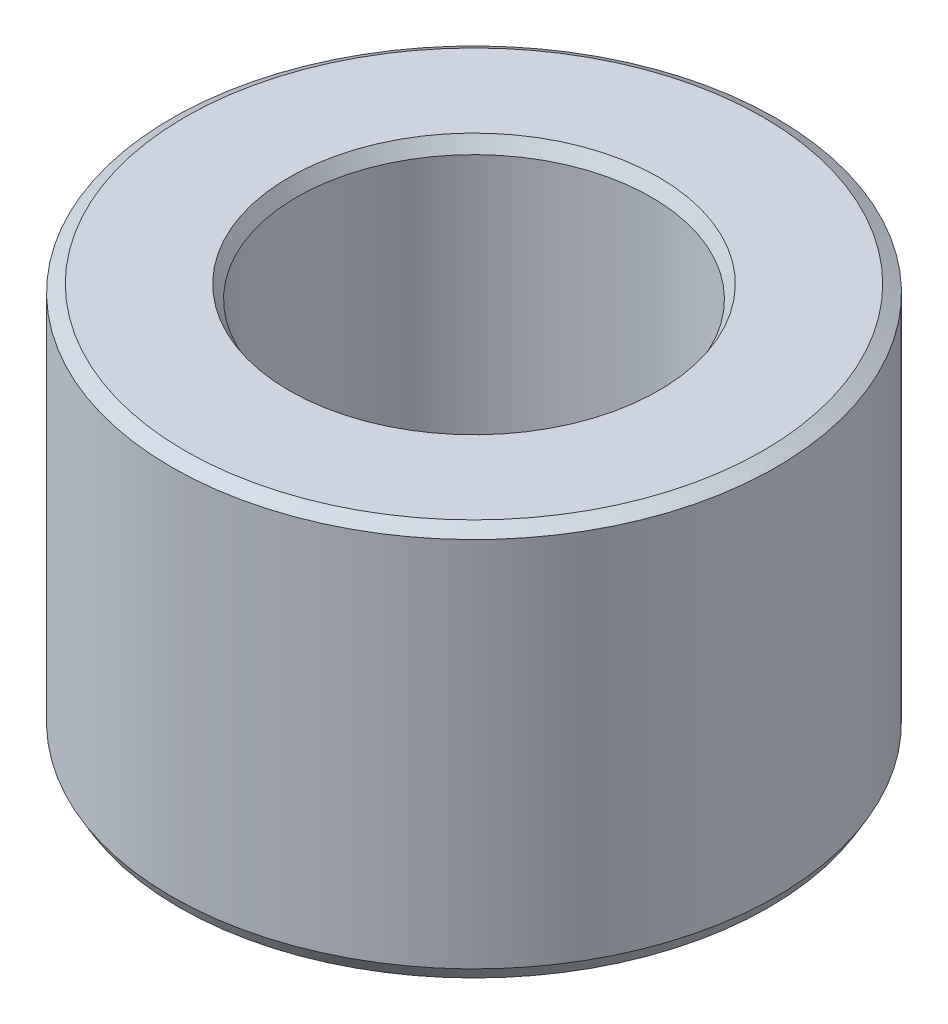
ISO-10303-21;
HEADER;
FILE_DESCRIPTION(('STEP AP214'),'2;1');
FILE_NAME('part.step','',(''),(''),'','','');
FILE_SCHEMA(('AUTOMOTIVE_DESIGN { 1 0 10303 214 1 1 1 1 }'));
ENDSEC;
DATA;
#1=APPLICATION_CONTEXT('core data for automotive mechanical design processes');
#2=APPLICATION_PROTOCOL_DEFINITION('international standard','automotive_design',2000,#1);
#3=PRODUCT_CONTEXT('',#1,'mechanical');
#4=PRODUCT('Part','Part','',(#3));
#5=PRODUCT_RELATED_PRODUCT_CATEGORY('part','',(#4));
#6=PRODUCT_DEFINITION_FORMATION('','',#4);
#7=PRODUCT_DEFINITION_CONTEXT('part definition',#1,'design');
#8=PRODUCT_DEFINITION('design','',#6,#7);
#9=PRODUCT_DEFINITION_SHAPE('','',#8);
#10=(LENGTH_UNIT() NAMED_UNIT(*) SI_UNIT(.MILLI.,.METRE.));
#11=(NAMED_UNIT(*) PLANE_ANGLE_UNIT() SI_UNIT($,.RADIAN.));
#12=(NAMED_UNIT(*) SI_UNIT($,.STERADIAN.) SOLID_ANGLE_UNIT());
#13=UNCERTAINTY_MEASURE_WITH_UNIT(LENGTH_MEASURE(1.E-05),#10,'distance_accuracy_value','');
#14=(GEOMETRIC_REPRESENTATION_CONTEXT(3) GLOBAL_UNCERTAINTY_ASSIGNED_CONTEXT((#13)) GLOBAL_UNIT_ASSIGNED_CONTEXT((#10,
#11,#12)) REPRESENTATION_CONTEXT('',''));
#15=CARTESIAN_POINT('',(0.,0.,0.));
#16=DIRECTION('',(0.,0.,1.));
#17=DIRECTION('',(1.,0.,0.));
#18=AXIS2_PLACEMENT_3D('',#15,#16,#17);
#19=CARTESIAN_POINT('',(0.,45.4759691105106,0.));
#20=DIRECTION('',(0.,-1.,0.));
#21=DIRECTION('',(0.,0.,-1.));
#22=AXIS2_PLACEMENT_3D('',#19,#20,#21);
#23=CYLINDRICAL_SURFACE('',#22,35.);
#24=CARTESIAN_POINT('',(0.,1.53578609781814,0.));
#25=DIRECTION('',(0.,1.,0.));
#26=DIRECTION('',(0.,0.,1.));
#27=AXIS2_PLACEMENT_3D('',#24,#25,#26);
#28=CIRCLE('',#27,35.);
#29=CARTESIAN_POINT('',(0.,1.53578609781814,35.));
#30=VERTEX_POINT('',#29);
#31=EDGE_CURVE('E10',#30,#30,#28,.T.);
#32=ORIENTED_EDGE('',*,*,#31,.T.);
#33=EDGE_LOOP('',(#32));
#34=FACE_BOUND('',#33,.T.);
#35=CARTESIAN_POINT('',(0.,44.5892825935176,0.));
#36=DIRECTION('',(0.,1.,0.));
#37=DIRECTION('',(0.,0.,1.));
#38=AXIS2_PLACEMENT_3D('',#35,#36,#37);
#39=CIRCLE('',#38,35.);
#40=CARTESIAN_POINT('',(0.,44.5892825935176,-35.));
#41=VERTEX_POINT('',#40);
#42=EDGE_CURVE('E50',#41,#41,#39,.F.);
#43=ORIENTED_EDGE('',*,*,#42,.T.);
#44=EDGE_LOOP('',(#43));
#45=FACE_BOUND('',#44,.T.);
#46=ADVANCED_FACE('F39',(#34,#45),#23,.T.);
#47=CARTESIAN_POINT('',(0.,45.4759691105106,0.));
#48=DIRECTION('',(0.,1.,0.));
#49=DIRECTION('',(0.,0.,1.));
#50=AXIS2_PLACEMENT_3D('',#47,#48,#49);
#51=PLANE('',#50);
#52=CARTESIAN_POINT('',(0.,45.4759691105106,0.));
#53=DIRECTION('',(0.,1.,0.));
#54=DIRECTION('',(0.,0.,1.));
#55=AXIS2_PLACEMENT_3D('',#52,#53,#54);
#56=CIRCLE('',#55,21.3956241786913);
#57=CARTESIAN_POINT('',(0.,45.4759691105106,21.3956241786913));
#58=VERTEX_POINT('',#57);
#59=EDGE_CURVE('E58',#58,#58,#56,.F.);
#60=ORIENTED_EDGE('',*,*,#59,.T.);
#61=EDGE_LOOP('',(#60));
#62=FACE_BOUND('',#61,.T.);
#63=CARTESIAN_POINT('',(0.,45.4759691105106,0.));
#64=DIRECTION('',(0.,1.,0.));
#65=DIRECTION('',(0.,0.,1.));
#66=AXIS2_PLACEMENT_3D('',#63,#64,#65);
#67=CIRCLE('',#66,33.4642139021818);
#68=CARTESIAN_POINT('',(0.,45.4759691105106,-33.4642139021819));
#69=VERTEX_POINT('',#68);
#70=EDGE_CURVE('E61',#69,#69,#67,.T.);
#71=ORIENTED_EDGE('',*,*,#70,.T.);
#72=EDGE_LOOP('',(#71));
#73=FACE_BOUND('',#72,.T.);
#74=ADVANCED_FACE('F88',(#62,#73),#51,.T.);
#75=CARTESIAN_POINT('',(0.,0.,0.));
#76=DIRECTION('',(0.,1.,0.));
#77=DIRECTION('',(0.,0.,1.));
#78=AXIS2_PLACEMENT_3D('',#75,#76,#77);
#79=PLANE('',#78);
#80=CARTESIAN_POINT('',(0.,0.,0.));
#81=DIRECTION('',(0.,1.,0.));
#82=DIRECTION('',(0.,0.,1.));
#83=AXIS2_PLACEMENT_3D('',#80,#81,#82);
#84=CIRCLE('',#83,22.0447237595164);
#85=CARTESIAN_POINT('',(0.,0.,22.0447237595164));
#86=VERTEX_POINT('',#85);
#87=EDGE_CURVE('E51',#86,#86,#84,.T.);
#88=ORIENTED_EDGE('',*,*,#87,.T.);
#89=EDGE_LOOP('',(#88));
#90=FACE_BOUND('',#89,.T.);
#91=CARTESIAN_POINT('',(0.,0.,0.));
#92=DIRECTION('',(0.,1.,0.));
#93=DIRECTION('',(0.,0.,1.));
#94=AXIS2_PLACEMENT_3D('',#91,#92,#93);
#95=CIRCLE('',#94,34.113313483007);
#96=CARTESIAN_POINT('',(0.,0.,34.113313483007));
#97=VERTEX_POINT('',#96);
#98=EDGE_CURVE('E54',#97,#97,#95,.F.);
#99=ORIENTED_EDGE('',*,*,#98,.T.);
#100=EDGE_LOOP('',(#99));
#101=FACE_BOUND('',#100,.T.);
#102=ADVANCED_FACE('F83',(#90,#101),#79,.F.);
#103=CARTESIAN_POINT('',(0.,45.4759691105106,0.));
#104=DIRECTION('',(0.,-1.,0.));
#105=DIRECTION('',(0.,0.,-1.));
#106=AXIS2_PLACEMENT_3D('',#103,#104,#105);
#107=CYLINDRICAL_SURFACE('',#106,20.5089376616983);
#108=CARTESIAN_POINT('',(0.,43.9401830126925,0.));
#109=DIRECTION('',(0.,1.,0.));
#110=DIRECTION('',(0.,0.,1.));
#111=AXIS2_PLACEMENT_3D('',#108,#109,#110);
#112=CIRCLE('',#111,20.5089376616983);
#113=CARTESIAN_POINT('',(0.,43.9401830126925,20.5089376616983));
#114=VERTEX_POINT('',#113);
#115=EDGE_CURVE('E67',#114,#114,#112,.T.);
#116=ORIENTED_EDGE('',*,*,#115,.T.);
#117=EDGE_LOOP('',(#116));
#118=FACE_BOUND('',#117,.T.);
#119=CARTESIAN_POINT('',(0.,0.886686516993008,0.));
#120=DIRECTION('',(0.,1.,0.));
#121=DIRECTION('',(0.,0.,1.));
#122=AXIS2_PLACEMENT_3D('',#119,#120,#121);
#123=CIRCLE('',#122,20.5089376616983);
#124=CARTESIAN_POINT('',(0.,0.886686516993008,20.5089376616983));
#125=VERTEX_POINT('',#124);
#126=EDGE_CURVE('E69',#125,#125,#123,.F.);
#127=ORIENTED_EDGE('',*,*,#126,.T.);
#128=EDGE_LOOP('',(#127));
#129=FACE_BOUND('',#128,.T.);
#130=ADVANCED_FACE('F71',(#118,#129),#107,.F.);
#131=CARTESIAN_POINT('',(0.,43.9401830126925,0.));
#132=DIRECTION('',(0.,1.,0.));
#133=DIRECTION('',(0.,0.,1.));
#134=AXIS2_PLACEMENT_3D('',#131,#132,#133);
#135=CONICAL_SURFACE('',#134,20.5089376616983,0.5235987755983);
#136=CARTESIAN_POINT('',(0.,45.4759691105106,21.3956241786913));
#137=CARTESIAN_POINT('',(0.,45.4599713386583,21.3863878608059));
#138=CARTESIAN_POINT('',(0.,45.4439735668061,21.3771515429206));
#139=CARTESIAN_POINT('',(0.,45.4119780231015,21.3586789071499));
#140=CARTESIAN_POINT('',(0.,45.3959802512493,21.3494425892646));
#141=CARTESIAN_POINT('',(0.,45.3639847075447,21.3309699534939));
#142=CARTESIAN_POINT('',(0.,45.3479869356924,21.3217336356085));
#143=CARTESIAN_POINT('',(0.,45.3159913919879,21.3032609998378));
#144=CARTESIAN_POINT('',(0.,45.2999936201356,21.2940246819525));
#145=CARTESIAN_POINT('',(0.,45.2679980764311,21.2755520461818));
#146=CARTESIAN_POINT('',(0.,45.2520003045788,21.2663157282965));
#147=CARTESIAN_POINT('',(0.,45.2200047608743,21.2478430925258));
#148=CARTESIAN_POINT('',(0.,45.204006989022,21.2386067746404));
#149=CARTESIAN_POINT('',(0.,45.1720114453174,21.2201341388697));
#150=CARTESIAN_POINT('',(0.,45.1560136734652,21.2108978209844));
#151=CARTESIAN_POINT('',(0.,45.1240181297606,21.1924251852137));
#152=CARTESIAN_POINT('',(0.,45.1080203579084,21.1831888673284));
#153=CARTESIAN_POINT('',(0.,45.0760248142038,21.1647162315577));
#154=CARTESIAN_POINT('',(0.,45.0600270423515,21.1554799136723));
#155=CARTESIAN_POINT('',(0.,45.028031498647,21.1370072779016));
#156=CARTESIAN_POINT('',(0.,45.0120337267947,21.1277709600163));
#157=CARTESIAN_POINT('',(0.,44.9800381830902,21.1092983242456));
#158=CARTESIAN_POINT('',(0.,44.9640404112379,21.1000620063603));
#159=CARTESIAN_POINT('',(0.,44.9320448675334,21.0815893705896));
#160=CARTESIAN_POINT('',(0.,44.9160470956811,21.0723530527042));
#161=CARTESIAN_POINT('',(0.,44.8840515519765,21.0538804169336));
#162=CARTESIAN_POINT('',(0.,44.8680537801243,21.0446440990482));
#163=CARTESIAN_POINT('',(0.,44.8360582364197,21.0261714632775));
#164=CARTESIAN_POINT('',(0.,44.8200604645674,21.0169351453922));
#165=CARTESIAN_POINT('',(0.,44.7880649208629,20.9984625096215));
#166=CARTESIAN_POINT('',(0.,44.7720671490106,20.9892261917361));
#167=CARTESIAN_POINT('',(0.,44.7400716053061,20.9707535559655));
#168=CARTESIAN_POINT('',(0.,44.7240738334538,20.9615172380801));
#169=CARTESIAN_POINT('',(0.,44.6920782897493,20.9430446023094));
#170=CARTESIAN_POINT('',(0.,44.676080517897,20.9338082844241));
#171=CARTESIAN_POINT('',(0.,44.6440849741925,20.9153356486534));
#172=CARTESIAN_POINT('',(0.,44.6280872023402,20.9060993307681));
#173=CARTESIAN_POINT('',(0.,44.5960916586356,20.8876266949974));
#174=CARTESIAN_POINT('',(0.,44.5800938867834,20.878390377112));
#175=CARTESIAN_POINT('',(0.,44.5480983430788,20.8599177413413));
#176=CARTESIAN_POINT('',(0.,44.5321005712266,20.850681423456));
#177=CARTESIAN_POINT('',(0.,44.500105027522,20.8322087876853));
#178=CARTESIAN_POINT('',(0.,44.4841072556697,20.8229724698));
#179=CARTESIAN_POINT('',(0.,44.4521117119652,20.8044998340293));
#180=CARTESIAN_POINT('',(0.,44.4361139401129,20.7952635161439));
#181=CARTESIAN_POINT('',(0.,44.4041183964084,20.7767908803732));
#182=CARTESIAN_POINT('',(0.,44.3881206245561,20.7675545624879));
#183=CARTESIAN_POINT('',(0.,44.3561250808515,20.7490819267172));
#184=CARTESIAN_POINT('',(0.,44.3401273089993,20.7398456088319));
#185=CARTESIAN_POINT('',(0.,44.3081317652947,20.7213729730612));
#186=CARTESIAN_POINT('',(0.,44.2921339934425,20.7121366551758));
#187=CARTESIAN_POINT('',(0.,44.2601384497379,20.6936640194051));
#188=CARTESIAN_POINT('',(0.,44.2441406778856,20.6844277015198));
#189=CARTESIAN_POINT('',(0.,44.2121451341811,20.6659550657491));
#190=CARTESIAN_POINT('',(0.,44.1961473623288,20.6567187478638));
#191=CARTESIAN_POINT('',(0.,44.1641518186243,20.6382461120931));
#192=CARTESIAN_POINT('',(0.,44.148154046772,20.6290097942077));
#193=CARTESIAN_POINT('',(0.,44.1161585030675,20.6105371584371));
#194=CARTESIAN_POINT('',(0.,44.1001607312152,20.6013008405517));
#195=CARTESIAN_POINT('',(0.,44.0681651875106,20.582828204781));
#196=CARTESIAN_POINT('',(0.,44.0521674156584,20.5735918868957));
#197=CARTESIAN_POINT('',(0.,44.0201718719538,20.555119251125));
#198=CARTESIAN_POINT('',(0.,44.0041741001016,20.5458829332396));
#199=CARTESIAN_POINT('',(0.,43.972178556397,20.527410297469));
#200=CARTESIAN_POINT('',(0.,43.9561807845447,20.5181739795836));
#201=CARTESIAN_POINT('',(0.,43.9401830126925,20.5089376616983));
#202=B_SPLINE_CURVE_WITH_KNOTS('',3,(#136,#137,#138,#139,#140,#141,#142,#143,#144,#145,#146,
#147,#148,#149,#150,#151,#152,#153,#154,#155,#156,#157,#158,#159,#160,#161,#162,#163,#164,#165,
#166,#167,#168,#169,#170,#171,#172,#173,#174,#175,#176,#177,#178,#179,#180,#181,#182,#183,#184,
#185,#186,#187,#188,#189,#190,#191,#192,#193,#194,#195,#196,#197,#198,#199,#200,#201),
.UNSPECIFIED.,.F.,.F.,(4,2,2,2,2,2,2,2,2,2,2,2,2,2,2,2,2,2,2,2,2,2,2,2,2,2,2,2,2,2,2,2,4),(0.,
0.0554179073120581,0.110835814624122,0.16625372193618,0.221671629248245,0.27708953656031,
0.332507443872369,0.387925351184433,0.443343258496491,0.498761165808555,0.554179073120613,
0.609596980432679,0.665014887744743,0.720432795056801,0.775850702368866,0.831268609680924,
0.88668651699299,0.942104424305054,0.997522331617112,1.05294023892918,1.10835814624123,
1.1637760535533,1.21919396086536,1.27461186817742,1.33002977548949,1.38544768280154,
1.44086559011361,1.49628349742567,1.55170140473773,1.6071193120498,1.66253721936185,
1.71795512667392,1.77337303398598),.UNSPECIFIED.);
#203=EDGE_CURVE('BSEAM77',#58,#114,#202,.T.);
#204=ORIENTED_EDGE('',*,*,#59,.F.);
#205=ORIENTED_EDGE('',*,*,#115,.F.);
#206=ORIENTED_EDGE('',*,*,#203,.T.);
#207=ORIENTED_EDGE('',*,*,#203,.F.);
#208=EDGE_LOOP('',(#204,#206,#205,#207));
#209=FACE_BOUND('',#208,.T.);
#210=ADVANCED_FACE('F77',(#209),#135,.F.);
#211=CARTESIAN_POINT('',(0.,0.,0.));
#212=DIRECTION('',(0.,-1.,0.));
#213=DIRECTION('',(0.,0.,-1.));
#214=AXIS2_PLACEMENT_3D('',#211,#212,#213);
#215=CONICAL_SURFACE('',#214,22.0447237595164,1.04719755119659);
#216=ORIENTED_EDGE('',*,*,#126,.F.);
#217=EDGE_LOOP('',(#216));
#218=FACE_BOUND('',#217,.T.);
#219=ORIENTED_EDGE('',*,*,#87,.F.);
#220=EDGE_LOOP('',(#219));
#221=FACE_BOUND('',#220,.T.);
#222=ADVANCED_FACE('F73',(#218,#221),#215,.F.);
#223=CARTESIAN_POINT('',(0.,1.53578609781814,0.));
#224=DIRECTION('',(0.,1.,0.));
#225=DIRECTION('',(0.,0.,1.));
#226=AXIS2_PLACEMENT_3D('',#223,#224,#225);
#227=CONICAL_SURFACE('',#226,35.,0.523598775598299);
#228=ORIENTED_EDGE('',*,*,#98,.F.);
#229=EDGE_LOOP('',(#228));
#230=FACE_BOUND('',#229,.T.);
#231=ORIENTED_EDGE('',*,*,#31,.F.);
#232=EDGE_LOOP('',(#231));
#233=FACE_BOUND('',#232,.T.);
#234=ADVANCED_FACE('F76',(#230,#233),#227,.T.);
#235=CARTESIAN_POINT('',(0.,45.4759691105106,0.));
#236=DIRECTION('',(0.,-1.,0.));
#237=DIRECTION('',(0.,0.,-1.));
#238=AXIS2_PLACEMENT_3D('',#235,#236,#237);
#239=CONICAL_SURFACE('',#238,33.4642139021818,1.0471975511966);
#240=CARTESIAN_POINT('',(0.,44.5892825935176,-35.));
#241=CARTESIAN_POINT('',(0.,44.598518911403,-34.9840022281477));
#242=CARTESIAN_POINT('',(0.,44.6077552292883,-34.9680044562955));
#243=CARTESIAN_POINT('',(0.,44.626227865059,-34.9360089125909));
#244=CARTESIAN_POINT('',(0.,44.6354641829443,-34.9200111407387));
#245=CARTESIAN_POINT('',(0.,44.653936818715,-34.8880155970341));
#246=CARTESIAN_POINT('',(0.,44.6631731366004,-34.8720178251818));
#247=CARTESIAN_POINT('',(0.,44.6816457723711,-34.8400222814773));
#248=CARTESIAN_POINT('',(0.,44.6908820902564,-34.824024509625));
#249=CARTESIAN_POINT('',(0.,44.7093547260271,-34.7920289659205));
#250=CARTESIAN_POINT('',(0.,44.7185910439124,-34.7760311940682));
#251=CARTESIAN_POINT('',(0.,44.7370636796831,-34.7440356503637));
#252=CARTESIAN_POINT('',(0.,44.7462999975685,-34.7280378785114));
#253=CARTESIAN_POINT('',(0.,44.7647726333391,-34.6960423348068));
#254=CARTESIAN_POINT('',(0.,44.7740089512245,-34.6800445629546));
#255=CARTESIAN_POINT('',(0.,44.7924815869952,-34.64804901925));
#256=CARTESIAN_POINT('',(0.,44.8017179048805,-34.6320512473978));
#257=CARTESIAN_POINT('',(0.,44.8201905406512,-34.6000557036932));
#258=CARTESIAN_POINT('',(0.,44.8294268585366,-34.5840579318409));
#259=CARTESIAN_POINT('',(0.,44.8478994943072,-34.5520623881364));
#260=CARTESIAN_POINT('',(0.,44.8571358121926,-34.5360646162841));
#261=CARTESIAN_POINT('',(0.,44.8756084479633,-34.5040690725796));
#262=CARTESIAN_POINT('',(0.,44.8848447658486,-34.4880713007273));
#263=CARTESIAN_POINT('',(0.,44.9033174016193,-34.4560757570228));
#264=CARTESIAN_POINT('',(0.,44.9125537195046,-34.4400779851705));
#265=CARTESIAN_POINT('',(0.,44.9310263552753,-34.4080824414659));
#266=CARTESIAN_POINT('',(0.,44.9402626731607,-34.3920846696137));
#267=CARTESIAN_POINT('',(0.,44.9587353089314,-34.3600891259091));
#268=CARTESIAN_POINT('',(0.,44.9679716268167,-34.3440913540568));
#269=CARTESIAN_POINT('',(0.,44.9864442625874,-34.3120958103523));
#270=CARTESIAN_POINT('',(0.,44.9956805804727,-34.2960980385));
#271=CARTESIAN_POINT('',(0.,45.0141532162434,-34.2641024947955));
#272=CARTESIAN_POINT('',(0.,45.0233895341288,-34.2481047229432));
#273=CARTESIAN_POINT('',(0.,45.0418621698995,-34.2161091792387));
#274=CARTESIAN_POINT('',(0.,45.0510984877848,-34.2001114073864));
#275=CARTESIAN_POINT('',(0.,45.0695711235555,-34.1681158636818));
#276=CARTESIAN_POINT('',(0.,45.0788074414408,-34.1521180918296));
#277=CARTESIAN_POINT('',(0.,45.0972800772115,-34.120122548125));
#278=CARTESIAN_POINT('',(0.,45.1065163950969,-34.1041247762728));
#279=CARTESIAN_POINT('',(0.,45.1249890308676,-34.0721292325682));
#280=CARTESIAN_POINT('',(0.,45.1342253487529,-34.0561314607159));
#281=CARTESIAN_POINT('',(0.,45.1526979845236,-34.0241359170114));
#282=CARTESIAN_POINT('',(0.,45.1619343024089,-34.0081381451591));
#283=CARTESIAN_POINT('',(0.,45.1804069381796,-33.9761426014546));
#284=CARTESIAN_POINT('',(0.,45.189643256065,-33.9601448296023));
#285=CARTESIAN_POINT('',(0.,45.2081158918356,-33.9281492858978));
#286=CARTESIAN_POINT('',(0.,45.217352209721,-33.9121515140455));
#287=CARTESIAN_POINT('',(0.,45.2358248454917,-33.8801559703409));
#288=CARTESIAN_POINT('',(0.,45.245061163377,-33.8641581984887));
#289=CARTESIAN_POINT('',(0.,45.2635337991477,-33.8321626547841));
#290=CARTESIAN_POINT('',(0.,45.2727701170331,-33.8161648829319));
#291=CARTESIAN_POINT('',(0.,45.2912427528037,-33.7841693392273));
#292=CARTESIAN_POINT('',(0.,45.3004790706891,-33.768171567375));
#293=CARTESIAN_POINT('',(0.,45.3189517064598,-33.7361760236705));
#294=CARTESIAN_POINT('',(0.,45.3281880243451,-33.7201782518182));
#295=CARTESIAN_POINT('',(0.,45.3466606601158,-33.6881827081137));
#296=CARTESIAN_POINT('',(0.,45.3558969780011,-33.6721849362614));
#297=CARTESIAN_POINT('',(0.,45.3743696137718,-33.6401893925568));
#298=CARTESIAN_POINT('',(0.,45.3836059316572,-33.6241916207046));
#299=CARTESIAN_POINT('',(0.,45.4020785674279,-33.592196077));
#300=CARTESIAN_POINT('',(0.,45.4113148853132,-33.5761983051478));
#301=CARTESIAN_POINT('',(0.,45.4297875210839,-33.5442027614432));
#302=CARTESIAN_POINT('',(0.,45.4390238389692,-33.5282049895909));
#303=CARTESIAN_POINT('',(0.,45.4574964747399,-33.4962094458864));
#304=CARTESIAN_POINT('',(0.,45.4667327926253,-33.4802116740341));
#305=CARTESIAN_POINT('',(0.,45.4759691105106,-33.4642139021819));
#306=B_SPLINE_CURVE_WITH_KNOTS('',3,(#240,#241,#242,#243,#244,#245,#246,#247,#248,#249,#250,
#251,#252,#253,#254,#255,#256,#257,#258,#259,#260,#261,#262,#263,#264,#265,#266,#267,#268,#269,
#270,#271,#272,#273,#274,#275,#276,#277,#278,#279,#280,#281,#282,#283,#284,#285,#286,#287,#288,
#289,#290,#291,#292,#293,#294,#295,#296,#297,#298,#299,#300,#301,#302,#303,#304,#305),
.UNSPECIFIED.,.F.,.F.,(4,2,2,2,2,2,2,2,2,2,2,2,2,2,2,2,2,2,2,2,2,2,2,2,2,2,2,2,2,2,2,2,4),(0.,
0.0554179073120676,0.110835814624126,0.16625372193619,0.221671629248254,0.277089536560312,
0.332507443872376,0.387925351184441,0.443343258496499,0.498761165808566,0.55417907312063,
0.609596980432689,0.665014887744753,0.720432795056817,0.775850702368875,0.831268609680939,
0.886686516993003,0.942104424305065,0.997522331617129,1.05294023892919,1.10835814624125,
1.16377605355332,1.21919396086538,1.27461186817744,1.3300297754895,1.38544768280157,
1.44086559011363,1.49628349742569,1.55170140473776,1.60711931204981,1.66253721936188,
1.71795512667394,1.773373033986),.UNSPECIFIED.);
#307=EDGE_CURVE('BSEAM45',#41,#69,#306,.T.);
#308=ORIENTED_EDGE('',*,*,#42,.F.);
#309=ORIENTED_EDGE('',*,*,#70,.F.);
#310=ORIENTED_EDGE('',*,*,#307,.T.);
#311=ORIENTED_EDGE('',*,*,#307,.F.);
#312=EDGE_LOOP('',(#308,#310,#309,#311));
#313=FACE_BOUND('',#312,.T.);
#314=ADVANCED_FACE('F45',(#313),#239,.T.);
#315=CLOSED_SHELL('',(#46,#74,#102,#130,#210,#222,#234,#314));
#316=MANIFOLD_SOLID_BREP('B2',#315);
#317=ADVANCED_BREP_SHAPE_REPRESENTATION('',(#18,#316),#14);
#318=SHAPE_DEFINITION_REPRESENTATION(#9,#317);
ENDSEC;
END-ISO-10303-21;
